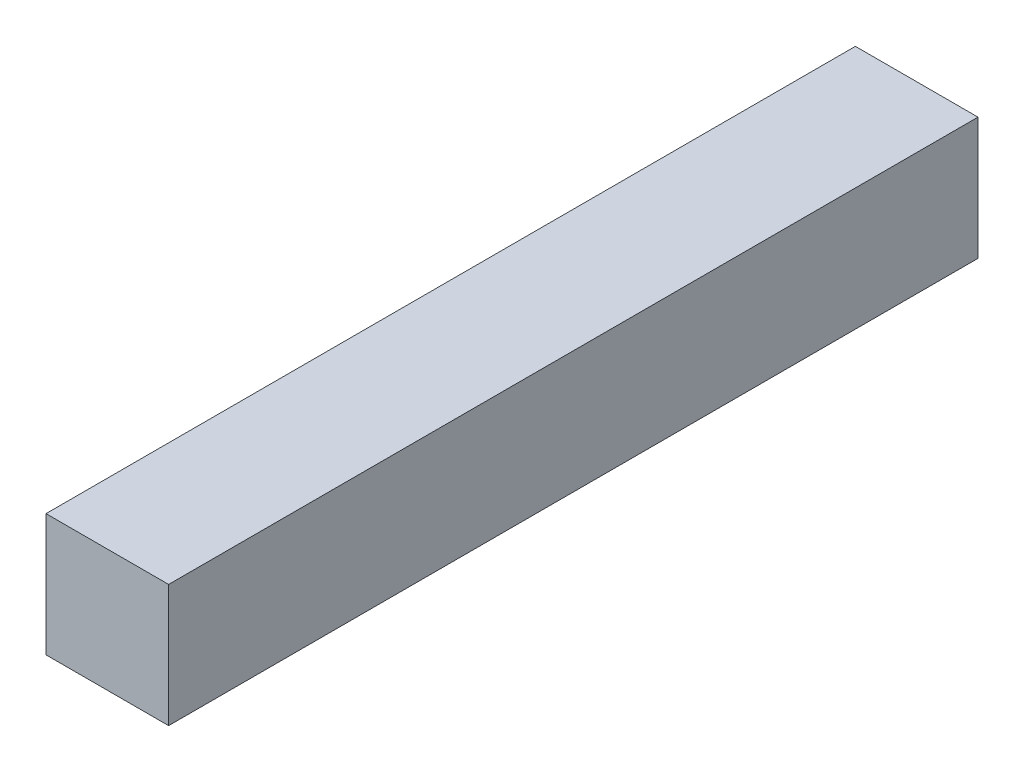
ISO-10303-21;
HEADER;
FILE_DESCRIPTION(('STEP AP214'),'2;1');
FILE_NAME('part.step','',(''),(''),'','','');
FILE_SCHEMA(('AUTOMOTIVE_DESIGN { 1 0 10303 214 1 1 1 1 }'));
ENDSEC;
DATA;
#1=APPLICATION_CONTEXT('core data for automotive mechanical design processes');
#2=APPLICATION_PROTOCOL_DEFINITION('international standard','automotive_design',2000,#1);
#3=PRODUCT_CONTEXT('',#1,'mechanical');
#4=PRODUCT('Part','Part','',(#3));
#5=PRODUCT_RELATED_PRODUCT_CATEGORY('part','',(#4));
#6=PRODUCT_DEFINITION_FORMATION('','',#4);
#7=PRODUCT_DEFINITION_CONTEXT('part definition',#1,'design');
#8=PRODUCT_DEFINITION('design','',#6,#7);
#9=PRODUCT_DEFINITION_SHAPE('','',#8);
#10=(LENGTH_UNIT() NAMED_UNIT(*) SI_UNIT(.MILLI.,.METRE.));
#11=(NAMED_UNIT(*) PLANE_ANGLE_UNIT() SI_UNIT($,.RADIAN.));
#12=(NAMED_UNIT(*) SI_UNIT($,.STERADIAN.) SOLID_ANGLE_UNIT());
#13=UNCERTAINTY_MEASURE_WITH_UNIT(LENGTH_MEASURE(1.E-05),#10,'distance_accuracy_value','');
#14=(GEOMETRIC_REPRESENTATION_CONTEXT(3) GLOBAL_UNCERTAINTY_ASSIGNED_CONTEXT((#13)) GLOBAL_UNIT_ASSIGNED_CONTEXT((#10,
#11,#12)) REPRESENTATION_CONTEXT('',''));
#15=CARTESIAN_POINT('',(0.,0.,0.));
#16=DIRECTION('',(0.,0.,1.));
#17=DIRECTION('',(1.,0.,0.));
#18=AXIS2_PLACEMENT_3D('',#15,#16,#17);
#19=CARTESIAN_POINT('',(-0.2499995,-0.24937212,0.));
#20=DIRECTION('',(0.,1.,0.));
#21=DIRECTION('',(0.,0.,1.));
#22=AXIS2_PLACEMENT_3D('',#19,#20,#21);
#23=PLANE('',#22);
#24=DIRECTION('',(0.,0.,1.));
#25=VECTOR('',#24,1.);
#26=CARTESIAN_POINT('',(0.2499995,-0.24937212,0.));
#27=LINE('',#26,#25);
#28=CARTESIAN_POINT('',(0.2499995,-0.24937212,0.));
#29=VERTEX_POINT('',#28);
#30=CARTESIAN_POINT('',(0.2499995,-0.24937212,3.29999848));
#31=VERTEX_POINT('',#30);
#32=EDGE_CURVE('E65',#29,#31,#27,.T.);
#33=ORIENTED_EDGE('',*,*,#32,.T.);
#34=DIRECTION('',(-1.,0.,0.));
#35=VECTOR('',#34,1.);
#36=CARTESIAN_POINT('',(0.2499995,-0.24937212,3.29999848));
#37=LINE('',#36,#35);
#38=CARTESIAN_POINT('',(-0.2499995,-0.24937212,3.29999848));
#39=VERTEX_POINT('',#38);
#40=EDGE_CURVE('E55',#31,#39,#37,.T.);
#41=ORIENTED_EDGE('',*,*,#40,.T.);
#42=DIRECTION('',(0.,0.,-1.));
#43=VECTOR('',#42,1.);
#44=CARTESIAN_POINT('',(-0.2499995,-0.24937212,0.));
#45=LINE('',#44,#43);
#46=CARTESIAN_POINT('',(-0.2499995,-0.24937212,0.));
#47=VERTEX_POINT('',#46);
#48=EDGE_CURVE('E75',#39,#47,#45,.T.);
#49=ORIENTED_EDGE('',*,*,#48,.T.);
#50=DIRECTION('',(1.,0.,0.));
#51=VECTOR('',#50,1.);
#52=CARTESIAN_POINT('',(-0.2499995,-0.24937212,0.));
#53=LINE('',#52,#51);
#54=EDGE_CURVE('E20',#29,#47,#53,.F.);
#55=ORIENTED_EDGE('',*,*,#54,.F.);
#56=EDGE_LOOP('',(#33,#41,#49,#55));
#57=FACE_BOUND('',#56,.T.);
#58=ADVANCED_FACE('F17',(#57),#23,.F.);
#59=CARTESIAN_POINT('',(0.2499995,-0.24937212,0.));
#60=DIRECTION('',(-1.,0.,0.));
#61=DIRECTION('',(0.,0.,1.));
#62=AXIS2_PLACEMENT_3D('',#59,#60,#61);
#63=PLANE('',#62);
#64=DIRECTION('',(0.,0.,-1.));
#65=VECTOR('',#64,1.);
#66=CARTESIAN_POINT('',(0.2499995,0.24937212,0.));
#67=LINE('',#66,#65);
#68=CARTESIAN_POINT('',(0.2499995,0.24937212,0.));
#69=VERTEX_POINT('',#68);
#70=CARTESIAN_POINT('',(0.2499995,0.24937212,3.29999848));
#71=VERTEX_POINT('',#70);
#72=EDGE_CURVE('E73',#69,#71,#67,.F.);
#73=ORIENTED_EDGE('',*,*,#72,.T.);
#74=DIRECTION('',(0.,1.,0.));
#75=VECTOR('',#74,1.);
#76=CARTESIAN_POINT('',(0.2499995,-0.24937212,3.29999848));
#77=LINE('',#76,#75);
#78=EDGE_CURVE('E62',#71,#31,#77,.F.);
#79=ORIENTED_EDGE('',*,*,#78,.T.);
#80=ORIENTED_EDGE('',*,*,#32,.F.);
#81=DIRECTION('',(0.,1.,0.));
#82=VECTOR('',#81,1.);
#83=CARTESIAN_POINT('',(0.2499995,-0.24937212,0.));
#84=LINE('',#83,#82);
#85=EDGE_CURVE('E80',#69,#29,#84,.F.);
#86=ORIENTED_EDGE('',*,*,#85,.F.);
#87=EDGE_LOOP('',(#73,#79,#80,#86));
#88=FACE_BOUND('',#87,.T.);
#89=ADVANCED_FACE('F72',(#88),#63,.F.);
#90=CARTESIAN_POINT('',(0.2499995,-0.24937212,3.29999848));
#91=DIRECTION('',(0.,0.,-1.));
#92=DIRECTION('',(-1.,0.,0.));
#93=AXIS2_PLACEMENT_3D('',#90,#91,#92);
#94=PLANE('',#93);
#95=DIRECTION('',(1.,0.,0.));
#96=VECTOR('',#95,1.);
#97=CARTESIAN_POINT('',(0.2499995,0.24937212,3.29999848));
#98=LINE('',#97,#96);
#99=CARTESIAN_POINT('',(-0.2499995,0.24937212,3.29999848));
#100=VERTEX_POINT('',#99);
#101=EDGE_CURVE('E83',#71,#100,#98,.F.);
#102=ORIENTED_EDGE('',*,*,#101,.T.);
#103=DIRECTION('',(0.,1.,0.));
#104=VECTOR('',#103,1.);
#105=CARTESIAN_POINT('',(-0.2499995,0.24937212,3.29999848));
#106=LINE('',#105,#104);
#107=EDGE_CURVE('E64',#100,#39,#106,.F.);
#108=ORIENTED_EDGE('',*,*,#107,.T.);
#109=ORIENTED_EDGE('',*,*,#40,.F.);
#110=ORIENTED_EDGE('',*,*,#78,.F.);
#111=EDGE_LOOP('',(#102,#108,#109,#110));
#112=FACE_BOUND('',#111,.T.);
#113=ADVANCED_FACE('F60',(#112),#94,.F.);
#114=CARTESIAN_POINT('',(-0.2499995,0.24937212,0.));
#115=DIRECTION('',(1.,0.,0.));
#116=DIRECTION('',(0.,0.,-1.));
#117=AXIS2_PLACEMENT_3D('',#114,#115,#116);
#118=PLANE('',#117);
#119=ORIENTED_EDGE('',*,*,#48,.F.);
#120=ORIENTED_EDGE('',*,*,#107,.F.);
#121=DIRECTION('',(0.,0.,-1.));
#122=VECTOR('',#121,1.);
#123=CARTESIAN_POINT('',(-0.2499995,0.24937212,0.));
#124=LINE('',#123,#122);
#125=CARTESIAN_POINT('',(-0.2499995,0.24937212,0.));
#126=VERTEX_POINT('',#125);
#127=EDGE_CURVE('E26',#100,#126,#124,.T.);
#128=ORIENTED_EDGE('',*,*,#127,.T.);
#129=DIRECTION('',(0.,1.,0.));
#130=VECTOR('',#129,1.);
#131=CARTESIAN_POINT('',(-0.2499995,-0.24937212,0.));
#132=LINE('',#131,#130);
#133=EDGE_CURVE('E34',#47,#126,#132,.T.);
#134=ORIENTED_EDGE('',*,*,#133,.F.);
#135=EDGE_LOOP('',(#119,#120,#128,#134));
#136=FACE_BOUND('',#135,.T.);
#137=ADVANCED_FACE('F88',(#136),#118,.F.);
#138=CARTESIAN_POINT('',(0.2499995,-0.24937212,0.));
#139=DIRECTION('',(0.,0.,-1.));
#140=DIRECTION('',(-1.,0.,0.));
#141=AXIS2_PLACEMENT_3D('',#138,#139,#140);
#142=PLANE('',#141);
#143=DIRECTION('',(1.,0.,0.));
#144=VECTOR('',#143,1.);
#145=CARTESIAN_POINT('',(0.2499995,0.24937212,0.));
#146=LINE('',#145,#144);
#147=EDGE_CURVE('E11',#126,#69,#146,.T.);
#148=ORIENTED_EDGE('',*,*,#147,.T.);
#149=ORIENTED_EDGE('',*,*,#85,.T.);
#150=ORIENTED_EDGE('',*,*,#54,.T.);
#151=ORIENTED_EDGE('',*,*,#133,.T.);
#152=EDGE_LOOP('',(#148,#149,#150,#151));
#153=FACE_BOUND('',#152,.T.);
#154=ADVANCED_FACE('F91',(#153),#142,.T.);
#155=CARTESIAN_POINT('',(0.2499995,0.24937212,0.));
#156=DIRECTION('',(0.,-1.,0.));
#157=DIRECTION('',(0.,0.,-1.));
#158=AXIS2_PLACEMENT_3D('',#155,#156,#157);
#159=PLANE('',#158);
#160=ORIENTED_EDGE('',*,*,#127,.F.);
#161=ORIENTED_EDGE('',*,*,#101,.F.);
#162=ORIENTED_EDGE('',*,*,#72,.F.);
#163=ORIENTED_EDGE('',*,*,#147,.F.);
#164=EDGE_LOOP('',(#160,#161,#162,#163));
#165=FACE_BOUND('',#164,.T.);
#166=ADVANCED_FACE('F90',(#165),#159,.F.);
#167=CLOSED_SHELL('',(#58,#89,#113,#137,#154,#166));
#168=MANIFOLD_SOLID_BREP('B1',#167);
#169=ADVANCED_BREP_SHAPE_REPRESENTATION('',(#18,#168),#14);
#170=SHAPE_DEFINITION_REPRESENTATION(#9,#169);
ENDSEC;
END-ISO-10303-21;
